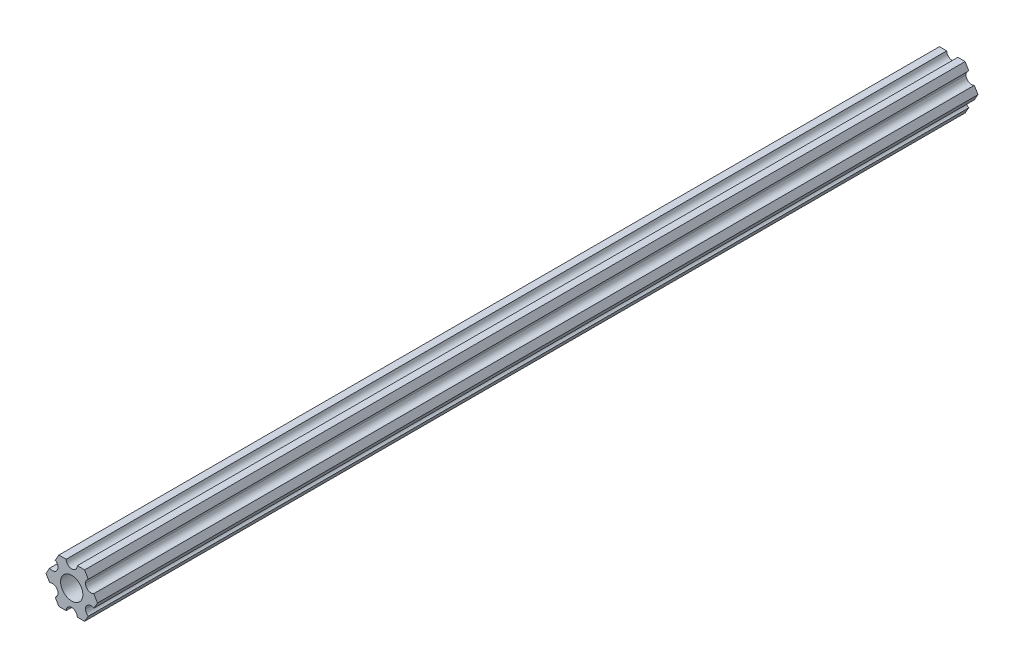
ISO-10303-21;
HEADER;
FILE_DESCRIPTION(('STEP AP214'),'2;1');
FILE_NAME('part.step','',(''),(''),'','','');
FILE_SCHEMA(('AUTOMOTIVE_DESIGN { 1 0 10303 214 1 1 1 1 }'));
ENDSEC;
DATA;
#1=APPLICATION_CONTEXT('core data for automotive mechanical design processes');
#2=APPLICATION_PROTOCOL_DEFINITION('international standard','automotive_design',2000,#1);
#3=PRODUCT_CONTEXT('',#1,'mechanical');
#4=PRODUCT('Part','Part','',(#3));
#5=PRODUCT_RELATED_PRODUCT_CATEGORY('part','',(#4));
#6=PRODUCT_DEFINITION_FORMATION('','',#4);
#7=PRODUCT_DEFINITION_CONTEXT('part definition',#1,'design');
#8=PRODUCT_DEFINITION('design','',#6,#7);
#9=PRODUCT_DEFINITION_SHAPE('','',#8);
#10=(LENGTH_UNIT() NAMED_UNIT(*) SI_UNIT(.MILLI.,.METRE.));
#11=(NAMED_UNIT(*) PLANE_ANGLE_UNIT() SI_UNIT($,.RADIAN.));
#12=(NAMED_UNIT(*) SI_UNIT($,.STERADIAN.) SOLID_ANGLE_UNIT());
#13=UNCERTAINTY_MEASURE_WITH_UNIT(LENGTH_MEASURE(1.E-05),#10,'distance_accuracy_value','');
#14=(GEOMETRIC_REPRESENTATION_CONTEXT(3) GLOBAL_UNCERTAINTY_ASSIGNED_CONTEXT((#13)) GLOBAL_UNIT_ASSIGNED_CONTEXT((#10,
#11,#12)) REPRESENTATION_CONTEXT('',''));
#15=CARTESIAN_POINT('',(0.,0.,0.));
#16=DIRECTION('',(0.,0.,1.));
#17=DIRECTION('',(1.,0.,0.));
#18=AXIS2_PLACEMENT_3D('',#15,#16,#17);
#19=CARTESIAN_POINT('',(-7.33234841870827,6.3499997778937,250.952));
#20=DIRECTION('',(0.,0.,-1.));
#21=DIRECTION('',(-1.,0.,0.));
#22=AXIS2_PLACEMENT_3D('',#19,#20,#21);
#23=PLANE('',#22);
#24=DIRECTION('',(1.,0.,0.));
#25=VECTOR('',#24,1.);
#26=CARTESIAN_POINT('',(-7.33234841870827,6.3499997778937,250.952));
#27=LINE('',#26,#25);
#28=CARTESIAN_POINT('',(-3.66617459405349,6.3499997778937,250.952));
#29=VERTEX_POINT('',#28);
#30=CARTESIAN_POINT('',(-1.58750038469926,6.3499997778937,250.952));
#31=VERTEX_POINT('',#30);
#32=EDGE_CURVE('E416',#29,#31,#27,.T.);
#33=ORIENTED_EDGE('',*,*,#32,.F.);
#34=DIRECTION('',(0.499999947533942,0.866025434075729,0.));
#35=VECTOR('',#34,1.);
#36=CARTESIAN_POINT('',(-3.66617459405349,6.3499997778937,250.952));
#37=LINE('',#36,#35);
#38=CARTESIAN_POINT('',(-4.70551158967065,4.54981504343587,250.952));
#39=VERTEX_POINT('',#38);
#40=EDGE_CURVE('E375',#39,#29,#37,.T.);
#41=ORIENTED_EDGE('',*,*,#40,.F.);
#42=CARTESIAN_POINT('',(-5.49926150638082,3.17499966684067,250.952));
#43=DIRECTION('',(0.,0.,-1.));
#44=DIRECTION('',(-1.,0.,0.));
#45=AXIS2_PLACEMENT_3D('',#42,#43,#44);
#46=CIRCLE('',#45,1.5875);
#47=CARTESIAN_POINT('',(-6.29301142309098,1.80018429024547,250.952));
#48=VERTEX_POINT('',#47);
#49=EDGE_CURVE('E378',#48,#39,#46,.F.);
#50=ORIENTED_EDGE('',*,*,#49,.F.);
#51=DIRECTION('',(0.499999947533952,0.866025434075724,0.));
#52=VECTOR('',#51,1.);
#53=CARTESIAN_POINT('',(-6.29301142309098,1.80018429024547,250.952));
#54=LINE('',#53,#52);
#55=CARTESIAN_POINT('',(-7.33234841870827,-4.44212523535714E-07,250.952));
#56=VERTEX_POINT('',#55);
#57=EDGE_CURVE('E381',#56,#48,#54,.T.);
#58=ORIENTED_EDGE('',*,*,#57,.F.);
#59=DIRECTION('',(-0.500000052466045,0.866025373493151,0.));
#60=VECTOR('',#59,1.);
#61=CARTESIAN_POINT('',(-7.33234841870827,-4.44212523790841E-07,250.952));
#62=LINE('',#61,#60);
#63=CARTESIAN_POINT('',(-6.29301120497141,-1.80018505273896,250.952));
#64=VERTEX_POINT('',#63);
#65=EDGE_CURVE('E384',#64,#56,#62,.T.);
#66=ORIENTED_EDGE('',*,*,#65,.F.);
#67=CARTESIAN_POINT('',(-5.49926112168156,-3.17500033315934,250.952));
#68=DIRECTION('',(0.,0.,-1.));
#69=DIRECTION('',(-1.,0.,0.));
#70=AXIS2_PLACEMENT_3D('',#67,#68,#69);
#71=CIRCLE('',#70,1.5875);
#72=CARTESIAN_POINT('',(-4.70551103839172,-4.54981561357972,250.952));
#73=VERTEX_POINT('',#72);
#74=EDGE_CURVE('E387',#73,#64,#71,.F.);
#75=ORIENTED_EDGE('',*,*,#74,.F.);
#76=DIRECTION('',(-0.500000052466045,0.866025373493152,0.));
#77=VECTOR('',#76,1.);
#78=CARTESIAN_POINT('',(-4.70551103839172,-4.54981561357972,250.952));
#79=LINE('',#78,#77);
#80=CARTESIAN_POINT('',(-3.66617382465481,-6.35000022210628,250.952));
#81=VERTEX_POINT('',#80);
#82=EDGE_CURVE('E390',#81,#73,#79,.T.);
#83=ORIENTED_EDGE('',*,*,#82,.F.);
#84=DIRECTION('',(1.,0.,0.));
#85=VECTOR('',#84,1.);
#86=CARTESIAN_POINT('',(-7.33234841870827,-6.35000022210628,250.952));
#87=LINE('',#86,#85);
#88=CARTESIAN_POINT('',(-1.58749961530072,-6.35000022210628,250.952));
#89=VERTEX_POINT('',#88);
#90=EDGE_CURVE('E419',#81,#89,#87,.T.);
#91=ORIENTED_EDGE('',*,*,#90,.T.);
#92=CARTESIAN_POINT('',(3.8469926204343E-07,-6.35,250.952));
#93=DIRECTION('',(0.,0.,-1.));
#94=DIRECTION('',(-1.,0.,0.));
#95=AXIS2_PLACEMENT_3D('',#92,#93,#94);
#96=CIRCLE('',#95,1.5875);
#97=CARTESIAN_POINT('',(1.58750038469926,-6.35000022210628,250.952));
#98=VERTEX_POINT('',#97);
#99=EDGE_CURVE('E393',#98,#89,#96,.F.);
#100=ORIENTED_EDGE('',*,*,#99,.F.);
#101=CARTESIAN_POINT('',(3.66617433758727,-6.35000022210628,250.952));
#102=VERTEX_POINT('',#101);
#103=EDGE_CURVE('E417',#98,#102,#87,.T.);
#104=ORIENTED_EDGE('',*,*,#103,.T.);
#105=DIRECTION('',(-0.499999947533941,-0.86602543407573,0.));
#106=VECTOR('',#105,1.);
#107=CARTESIAN_POINT('',(3.66617459405346,-6.34999977789375,250.952));
#108=LINE('',#107,#106);
#109=CARTESIAN_POINT('',(4.70551158967065,-4.54981504343587,250.952));
#110=VERTEX_POINT('',#109);
#111=EDGE_CURVE('E412',#110,#102,#108,.T.);
#112=ORIENTED_EDGE('',*,*,#111,.F.);
#113=CARTESIAN_POINT('',(5.49926150638082,-3.17499966684067,250.952));
#114=DIRECTION('',(0.,0.,-1.));
#115=DIRECTION('',(-1.,0.,0.));
#116=AXIS2_PLACEMENT_3D('',#113,#114,#115);
#117=CIRCLE('',#116,1.5875);
#118=CARTESIAN_POINT('',(3.91176150638082,-3.17499966684067,250.952));
#119=VERTEX_POINT('',#118);
#120=EDGE_CURVE('E414',#119,#110,#117,.F.);
#121=ORIENTED_EDGE('',*,*,#120,.F.);
#122=CARTESIAN_POINT('',(5.49926150638082,-3.17499966684067,250.952));
#123=DIRECTION('',(0.,0.,-1.));
#124=DIRECTION('',(-1.,0.,0.));
#125=AXIS2_PLACEMENT_3D('',#122,#123,#124);
#126=CIRCLE('',#125,1.5875);
#127=CARTESIAN_POINT('',(6.29301142309098,-1.80018429024546,250.952));
#128=VERTEX_POINT('',#127);
#129=EDGE_CURVE('E409',#128,#119,#126,.F.);
#130=ORIENTED_EDGE('',*,*,#129,.F.);
#131=DIRECTION('',(-0.499999947533953,-0.866025434075723,0.));
#132=VECTOR('',#131,1.);
#133=CARTESIAN_POINT('',(6.29301142309098,-1.80018429024546,250.952));
#134=LINE('',#133,#132);
#135=CARTESIAN_POINT('',(7.33234841870827,4.44212519198905E-07,250.952));
#136=VERTEX_POINT('',#135);
#137=EDGE_CURVE('E406',#136,#128,#134,.T.);
#138=ORIENTED_EDGE('',*,*,#137,.F.);
#139=DIRECTION('',(0.500000052466057,-0.866025373493145,0.));
#140=VECTOR('',#139,1.);
#141=CARTESIAN_POINT('',(7.33234841870827,4.44212519169686E-07,250.952));
#142=LINE('',#141,#140);
#143=CARTESIAN_POINT('',(6.2930112049714,1.80018505273894,250.952));
#144=VERTEX_POINT('',#143);
#145=EDGE_CURVE('E404',#144,#136,#142,.T.);
#146=ORIENTED_EDGE('',*,*,#145,.F.);
#147=CARTESIAN_POINT('',(5.49926112168156,3.17500033315934,250.952));
#148=DIRECTION('',(0.,0.,-1.));
#149=DIRECTION('',(-1.,0.,0.));
#150=AXIS2_PLACEMENT_3D('',#147,#148,#149);
#151=CIRCLE('',#150,1.5875);
#152=CARTESIAN_POINT('',(3.91176112168156,3.17500033315934,250.952));
#153=VERTEX_POINT('',#152);
#154=EDGE_CURVE('E402',#153,#144,#151,.F.);
#155=ORIENTED_EDGE('',*,*,#154,.F.);
#156=CARTESIAN_POINT('',(5.49926112168156,3.17500033315934,250.952));
#157=DIRECTION('',(0.,0.,-1.));
#158=DIRECTION('',(-1.,0.,0.));
#159=AXIS2_PLACEMENT_3D('',#156,#157,#158);
#160=CIRCLE('',#159,1.5875);
#161=CARTESIAN_POINT('',(4.70551103839172,4.54981561357972,250.952));
#162=VERTEX_POINT('',#161);
#163=EDGE_CURVE('E399',#162,#153,#160,.F.);
#164=ORIENTED_EDGE('',*,*,#163,.F.);
#165=DIRECTION('',(0.500000052466046,-0.866025373493151,0.));
#166=VECTOR('',#165,1.);
#167=CARTESIAN_POINT('',(4.70551103839172,4.54981561357972,250.952));
#168=LINE('',#167,#166);
#169=CARTESIAN_POINT('',(3.66617382465481,6.3499997778937,250.952));
#170=VERTEX_POINT('',#169);
#171=EDGE_CURVE('E396',#170,#162,#168,.T.);
#172=ORIENTED_EDGE('',*,*,#171,.F.);
#173=CARTESIAN_POINT('',(1.58749961530072,6.3499997778937,250.952));
#174=VERTEX_POINT('',#173);
#175=EDGE_CURVE('E421',#174,#170,#27,.T.);
#176=ORIENTED_EDGE('',*,*,#175,.F.);
#177=CARTESIAN_POINT('',(-3.84699260060323E-07,6.35,250.952));
#178=DIRECTION('',(0.,0.,-1.));
#179=DIRECTION('',(-1.,0.,0.));
#180=AXIS2_PLACEMENT_3D('',#177,#178,#179);
#181=CIRCLE('',#180,1.5875);
#182=EDGE_CURVE('E372',#31,#174,#181,.F.);
#183=ORIENTED_EDGE('',*,*,#182,.F.);
#184=EDGE_LOOP('',(#33,#41,#50,#58,#66,#75,#83,#91,#100,#104,#112,#121,#130,#138,#146,#155,#164,
#172,#176,#183));
#185=FACE_BOUND('',#184,.T.);
#186=CARTESIAN_POINT('',(0.,0.,250.952));
#187=DIRECTION('',(0.,0.,1.));
#188=DIRECTION('',(1.,0.,0.));
#189=AXIS2_PLACEMENT_3D('',#186,#187,#188);
#190=CIRCLE('',#189,3.17499999999999);
#191=CARTESIAN_POINT('',(3.17499999999999,0.,250.952));
#192=VERTEX_POINT('',#191);
#193=EDGE_CURVE('E434',#192,#192,#190,.T.);
#194=ORIENTED_EDGE('',*,*,#193,.F.);
#195=EDGE_LOOP('',(#194));
#196=FACE_BOUND('',#195,.T.);
#197=ADVANCED_FACE('F56',(#185,#196),#23,.F.);
#198=CARTESIAN_POINT('',(5.49926112168156,3.17500033315934,0.));
#199=DIRECTION('',(0.,0.,1.));
#200=DIRECTION('',(1.,0.,0.));
#201=AXIS2_PLACEMENT_3D('',#198,#199,#200);
#202=PLANE('',#201);
#203=DIRECTION('',(0.499999947533953,0.866025434075723,0.));
#204=VECTOR('',#203,1.);
#205=CARTESIAN_POINT('',(6.29301142309098,-1.80018429024546,0.));
#206=LINE('',#205,#204);
#207=CARTESIAN_POINT('',(6.29301142309098,-1.80018429024546,0.));
#208=VERTEX_POINT('',#207);
#209=CARTESIAN_POINT('',(7.33234841870827,4.44212519169686E-07,0.));
#210=VERTEX_POINT('',#209);
#211=EDGE_CURVE('E253',#208,#210,#206,.T.);
#212=ORIENTED_EDGE('',*,*,#211,.F.);
#213=CARTESIAN_POINT('',(5.49926150638082,-3.17499966684067,0.));
#214=DIRECTION('',(0.,0.,-1.));
#215=DIRECTION('',(1.,0.,0.));
#216=AXIS2_PLACEMENT_3D('',#213,#214,#215);
#217=CIRCLE('',#216,1.5875);
#218=CARTESIAN_POINT('',(3.91176150638082,-3.17499966684067,0.));
#219=VERTEX_POINT('',#218);
#220=EDGE_CURVE('E233',#219,#208,#217,.T.);
#221=ORIENTED_EDGE('',*,*,#220,.F.);
#222=CARTESIAN_POINT('',(5.49926150638082,-3.17499966684067,0.));
#223=DIRECTION('',(0.,0.,-1.));
#224=DIRECTION('',(1.,0.,0.));
#225=AXIS2_PLACEMENT_3D('',#222,#223,#224);
#226=CIRCLE('',#225,1.5875);
#227=CARTESIAN_POINT('',(4.70551158967065,-4.54981504343587,0.));
#228=VERTEX_POINT('',#227);
#229=EDGE_CURVE('E325',#228,#219,#226,.T.);
#230=ORIENTED_EDGE('',*,*,#229,.F.);
#231=DIRECTION('',(0.499999947533941,0.86602543407573,0.));
#232=VECTOR('',#231,1.);
#233=CARTESIAN_POINT('',(3.66617459405346,-6.34999977789375,0.));
#234=LINE('',#233,#232);
#235=CARTESIAN_POINT('',(3.66617459405346,-6.34999977789375,0.));
#236=VERTEX_POINT('',#235);
#237=EDGE_CURVE('E296',#236,#228,#234,.T.);
#238=ORIENTED_EDGE('',*,*,#237,.F.);
#239=DIRECTION('',(1.,6.05825721258438E-08,0.));
#240=VECTOR('',#239,1.);
#241=CARTESIAN_POINT('',(1.58750038469926,-6.34999990382518,0.));
#242=LINE('',#241,#240);
#243=CARTESIAN_POINT('',(1.58750038469926,-6.34999990382518,0.));
#244=VERTEX_POINT('',#243);
#245=EDGE_CURVE('E239',#244,#236,#242,.T.);
#246=ORIENTED_EDGE('',*,*,#245,.F.);
#247=CARTESIAN_POINT('',(3.8469926204343E-07,-6.35,0.));
#248=DIRECTION('',(0.,0.,-1.));
#249=DIRECTION('',(1.,0.,0.));
#250=AXIS2_PLACEMENT_3D('',#247,#248,#249);
#251=CIRCLE('',#250,1.5875);
#252=CARTESIAN_POINT('',(-1.58749961530073,-6.35000009617482,0.));
#253=VERTEX_POINT('',#252);
#254=EDGE_CURVE('E287',#253,#244,#251,.T.);
#255=ORIENTED_EDGE('',*,*,#254,.F.);
#256=DIRECTION('',(1.,6.05825854783851E-08,0.));
#257=VECTOR('',#256,1.);
#258=CARTESIAN_POINT('',(-3.66617382465481,-6.35000022210628,0.));
#259=LINE('',#258,#257);
#260=CARTESIAN_POINT('',(-3.66617382465481,-6.35000022210628,0.));
#261=VERTEX_POINT('',#260);
#262=EDGE_CURVE('E356',#261,#253,#259,.T.);
#263=ORIENTED_EDGE('',*,*,#262,.F.);
#264=DIRECTION('',(0.500000052466045,-0.866025373493152,0.));
#265=VECTOR('',#264,1.);
#266=CARTESIAN_POINT('',(-4.70551103839172,-4.54981561357972,0.));
#267=LINE('',#266,#265);
#268=CARTESIAN_POINT('',(-4.70551103839172,-4.54981561357972,0.));
#269=VERTEX_POINT('',#268);
#270=EDGE_CURVE('E260',#269,#261,#267,.T.);
#271=ORIENTED_EDGE('',*,*,#270,.F.);
#272=CARTESIAN_POINT('',(-5.49926112168156,-3.17500033315934,0.));
#273=DIRECTION('',(0.,0.,-1.));
#274=DIRECTION('',(1.,0.,0.));
#275=AXIS2_PLACEMENT_3D('',#272,#273,#274);
#276=CIRCLE('',#275,1.5875);
#277=CARTESIAN_POINT('',(-6.29301120497141,-1.80018505273897,0.));
#278=VERTEX_POINT('',#277);
#279=EDGE_CURVE('E285',#278,#269,#276,.T.);
#280=ORIENTED_EDGE('',*,*,#279,.F.);
#281=DIRECTION('',(0.500000052466045,-0.866025373493151,0.));
#282=VECTOR('',#281,1.);
#283=CARTESIAN_POINT('',(-7.33234841870827,-4.44212523790841E-07,0.));
#284=LINE('',#283,#282);
#285=CARTESIAN_POINT('',(-7.33234841870827,-4.44212523790841E-07,0.));
#286=VERTEX_POINT('',#285);
#287=EDGE_CURVE('E284',#286,#278,#284,.T.);
#288=ORIENTED_EDGE('',*,*,#287,.F.);
#289=DIRECTION('',(-0.499999947533951,-0.866025434075724,0.));
#290=VECTOR('',#289,1.);
#291=CARTESIAN_POINT('',(-6.29301142309098,1.80018429024547,0.));
#292=LINE('',#291,#290);
#293=CARTESIAN_POINT('',(-6.29301142309098,1.80018429024547,0.));
#294=VERTEX_POINT('',#293);
#295=EDGE_CURVE('E269',#294,#286,#292,.T.);
#296=ORIENTED_EDGE('',*,*,#295,.F.);
#297=CARTESIAN_POINT('',(-5.49926150638082,3.17499966684067,0.));
#298=DIRECTION('',(0.,0.,-1.));
#299=DIRECTION('',(1.,0.,0.));
#300=AXIS2_PLACEMENT_3D('',#297,#298,#299);
#301=CIRCLE('',#300,1.5875);
#302=CARTESIAN_POINT('',(-4.70551158967065,4.54981504343587,0.));
#303=VERTEX_POINT('',#302);
#304=EDGE_CURVE('E237',#303,#294,#301,.T.);
#305=ORIENTED_EDGE('',*,*,#304,.F.);
#306=DIRECTION('',(-0.499999947533943,-0.866025434075729,0.));
#307=VECTOR('',#306,1.);
#308=CARTESIAN_POINT('',(-3.66617459405349,6.3499997778937,0.));
#309=LINE('',#308,#307);
#310=CARTESIAN_POINT('',(-3.66617459405349,6.3499997778937,0.));
#311=VERTEX_POINT('',#310);
#312=EDGE_CURVE('E245',#311,#303,#309,.T.);
#313=ORIENTED_EDGE('',*,*,#312,.F.);
#314=DIRECTION('',(-1.,-6.05825963273174E-08,0.));
#315=VECTOR('',#314,1.);
#316=CARTESIAN_POINT('',(-1.58750038469926,6.34999990382518,0.));
#317=LINE('',#316,#315);
#318=CARTESIAN_POINT('',(-1.58750038469926,6.34999990382519,0.));
#319=VERTEX_POINT('',#318);
#320=EDGE_CURVE('E311',#319,#311,#317,.T.);
#321=ORIENTED_EDGE('',*,*,#320,.F.);
#322=CARTESIAN_POINT('',(-3.84699260060323E-07,6.35,0.));
#323=DIRECTION('',(0.,0.,-1.));
#324=DIRECTION('',(1.,0.,0.));
#325=AXIS2_PLACEMENT_3D('',#322,#323,#324);
#326=CIRCLE('',#325,1.5875);
#327=CARTESIAN_POINT('',(1.58749961530074,6.35000009617482,0.));
#328=VERTEX_POINT('',#327);
#329=EDGE_CURVE('E301',#328,#319,#326,.T.);
#330=ORIENTED_EDGE('',*,*,#329,.F.);
#331=DIRECTION('',(-1.,-6.05825850611185E-08,0.));
#332=VECTOR('',#331,1.);
#333=CARTESIAN_POINT('',(3.66617382465481,6.35000022210627,0.));
#334=LINE('',#333,#332);
#335=CARTESIAN_POINT('',(3.66617382465481,6.35000022210627,0.));
#336=VERTEX_POINT('',#335);
#337=EDGE_CURVE('E277',#336,#328,#334,.T.);
#338=ORIENTED_EDGE('',*,*,#337,.F.);
#339=DIRECTION('',(-0.500000052466046,0.866025373493151,0.));
#340=VECTOR('',#339,1.);
#341=CARTESIAN_POINT('',(4.70551103839172,4.54981561357972,0.));
#342=LINE('',#341,#340);
#343=CARTESIAN_POINT('',(4.70551103839172,4.54981561357972,0.));
#344=VERTEX_POINT('',#343);
#345=EDGE_CURVE('E270',#344,#336,#342,.T.);
#346=ORIENTED_EDGE('',*,*,#345,.F.);
#347=CARTESIAN_POINT('',(5.49926112168156,3.17500033315934,0.));
#348=DIRECTION('',(0.,0.,-1.));
#349=DIRECTION('',(1.,0.,0.));
#350=AXIS2_PLACEMENT_3D('',#347,#348,#349);
#351=CIRCLE('',#350,1.5875);
#352=CARTESIAN_POINT('',(3.91176112168156,3.17500033315934,0.));
#353=VERTEX_POINT('',#352);
#354=EDGE_CURVE('E255',#353,#344,#351,.T.);
#355=ORIENTED_EDGE('',*,*,#354,.F.);
#356=CARTESIAN_POINT('',(5.49926112168156,3.17500033315934,0.));
#357=DIRECTION('',(0.,0.,-1.));
#358=DIRECTION('',(1.,0.,0.));
#359=AXIS2_PLACEMENT_3D('',#356,#357,#358);
#360=CIRCLE('',#359,1.5875);
#361=CARTESIAN_POINT('',(6.29301120497139,1.80018505273894,0.));
#362=VERTEX_POINT('',#361);
#363=EDGE_CURVE('E274',#362,#353,#360,.T.);
#364=ORIENTED_EDGE('',*,*,#363,.F.);
#365=DIRECTION('',(-0.500000052466056,0.866025373493145,0.));
#366=VECTOR('',#365,1.);
#367=CARTESIAN_POINT('',(7.33234841870827,4.44212519169686E-07,0.));
#368=LINE('',#367,#366);
#369=EDGE_CURVE('E254',#210,#362,#368,.T.);
#370=ORIENTED_EDGE('',*,*,#369,.F.);
#371=EDGE_LOOP('',(#212,#221,#230,#238,#246,#255,#263,#271,#280,#288,#296,#305,#313,#321,#330,
#338,#346,#355,#364,#370));
#372=FACE_BOUND('',#371,.T.);
#373=CARTESIAN_POINT('',(0.,0.,0.));
#374=DIRECTION('',(0.,0.,-1.));
#375=DIRECTION('',(-1.,0.,0.));
#376=AXIS2_PLACEMENT_3D('',#373,#374,#375);
#377=CIRCLE('',#376,3.175);
#378=CARTESIAN_POINT('',(-3.175,0.,0.));
#379=VERTEX_POINT('',#378);
#380=EDGE_CURVE('E428',#379,#379,#377,.T.);
#381=ORIENTED_EDGE('',*,*,#380,.F.);
#382=EDGE_LOOP('',(#381));
#383=FACE_BOUND('',#382,.T.);
#384=ADVANCED_FACE('F441',(#372,#383),#202,.F.);
#385=CARTESIAN_POINT('',(0.,0.,304.8));
#386=DIRECTION('',(0.,0.,-1.));
#387=DIRECTION('',(-1.,0.,0.));
#388=AXIS2_PLACEMENT_3D('',#385,#386,#387);
#389=CYLINDRICAL_SURFACE('',#388,2.9337);
#390=DIRECTION('',(0.,0.,-1.));
#391=VECTOR('',#390,1.);
#392=CARTESIAN_POINT('',(-2.9337,0.,304.8));
#393=LINE('',#392,#391);
#394=CARTESIAN_POINT('',(-2.9337,0.,228.727));
#395=VERTEX_POINT('',#394);
#396=CARTESIAN_POINT('',(-2.9337,0.,22.225));
#397=VERTEX_POINT('',#396);
#398=EDGE_CURVE('E225',#395,#397,#393,.T.);
#399=ORIENTED_EDGE('',*,*,#398,.F.);
#400=CARTESIAN_POINT('',(0.,0.,228.727));
#401=DIRECTION('',(0.,0.,-1.));
#402=DIRECTION('',(-1.,0.,0.));
#403=AXIS2_PLACEMENT_3D('',#400,#401,#402);
#404=CIRCLE('',#403,2.9337);
#405=CARTESIAN_POINT('',(2.9337,0.,228.727));
#406=VERTEX_POINT('',#405);
#407=EDGE_CURVE('E64',#395,#406,#404,.F.);
#408=ORIENTED_EDGE('',*,*,#407,.T.);
#409=DIRECTION('',(0.,0.,-1.));
#410=VECTOR('',#409,1.);
#411=CARTESIAN_POINT('',(2.9337,0.,304.8));
#412=LINE('',#411,#410);
#413=CARTESIAN_POINT('',(2.9337,0.,22.225));
#414=VERTEX_POINT('',#413);
#415=EDGE_CURVE('E75',#406,#414,#412,.T.);
#416=ORIENTED_EDGE('',*,*,#415,.T.);
#417=CARTESIAN_POINT('',(0.,0.,22.225));
#418=DIRECTION('',(0.,0.,1.));
#419=DIRECTION('',(1.,0.,0.));
#420=AXIS2_PLACEMENT_3D('',#417,#418,#419);
#421=CIRCLE('',#420,2.9337);
#422=EDGE_CURVE('E420',#414,#397,#421,.F.);
#423=ORIENTED_EDGE('',*,*,#422,.T.);
#424=EDGE_LOOP('',(#399,#408,#416,#423));
#425=FACE_BOUND('',#424,.T.);
#426=ADVANCED_FACE('F224',(#425),#389,.F.);
#427=CARTESIAN_POINT('',(5.49926150638082,-3.17499966684067,304.8));
#428=DIRECTION('',(0.,0.,-1.));
#429=DIRECTION('',(-1.,0.,0.));
#430=AXIS2_PLACEMENT_3D('',#427,#428,#429);
#431=CYLINDRICAL_SURFACE('',#430,1.5875);
#432=DIRECTION('',(0.,0.,-1.));
#433=VECTOR('',#432,1.);
#434=CARTESIAN_POINT('',(6.29301142309098,-1.80018429024546,304.8));
#435=LINE('',#434,#433);
#436=EDGE_CURVE('E251',#128,#208,#435,.T.);
#437=ORIENTED_EDGE('',*,*,#436,.F.);
#438=ORIENTED_EDGE('',*,*,#129,.T.);
#439=DIRECTION('',(0.,0.,-1.));
#440=VECTOR('',#439,1.);
#441=CARTESIAN_POINT('',(3.91176150638082,-3.17499966684067,304.8));
#442=LINE('',#441,#440);
#443=EDGE_CURVE('E230',#119,#219,#442,.T.);
#444=ORIENTED_EDGE('',*,*,#443,.T.);
#445=ORIENTED_EDGE('',*,*,#220,.T.);
#446=EDGE_LOOP('',(#437,#438,#444,#445));
#447=FACE_BOUND('',#446,.T.);
#448=ADVANCED_FACE('F494',(#447),#431,.F.);
#449=CARTESIAN_POINT('',(5.49926112168156,3.17500033315934,304.8));
#450=DIRECTION('',(0.,0.,-1.));
#451=DIRECTION('',(-1.,0.,0.));
#452=AXIS2_PLACEMENT_3D('',#449,#450,#451);
#453=CYLINDRICAL_SURFACE('',#452,1.5875);
#454=DIRECTION('',(0.,0.,-1.));
#455=VECTOR('',#454,1.);
#456=CARTESIAN_POINT('',(4.70551103839172,4.54981561357972,304.8));
#457=LINE('',#456,#455);
#458=EDGE_CURVE('E275',#162,#344,#457,.T.);
#459=ORIENTED_EDGE('',*,*,#458,.F.);
#460=ORIENTED_EDGE('',*,*,#163,.T.);
#461=DIRECTION('',(0.,0.,-1.));
#462=VECTOR('',#461,1.);
#463=CARTESIAN_POINT('',(3.91176112168156,3.17500033315934,304.8));
#464=LINE('',#463,#462);
#465=EDGE_CURVE('E259',#153,#353,#464,.T.);
#466=ORIENTED_EDGE('',*,*,#465,.T.);
#467=ORIENTED_EDGE('',*,*,#354,.T.);
#468=EDGE_LOOP('',(#459,#460,#466,#467));
#469=FACE_BOUND('',#468,.T.);
#470=ADVANCED_FACE('F497',(#469),#453,.F.);
#471=CARTESIAN_POINT('',(6.29301142309098,-1.80018429024546,304.8));
#472=DIRECTION('',(-0.866025434075723,0.499999947533953,0.));
#473=DIRECTION('',(0.,0.,1.));
#474=AXIS2_PLACEMENT_3D('',#471,#472,#473);
#475=PLANE('',#474);
#476=DIRECTION('',(0.,0.,-1.));
#477=VECTOR('',#476,1.);
#478=CARTESIAN_POINT('',(7.33234841870827,4.44212519169686E-07,304.8));
#479=LINE('',#478,#477);
#480=EDGE_CURVE('E335',#136,#210,#479,.T.);
#481=ORIENTED_EDGE('',*,*,#480,.F.);
#482=ORIENTED_EDGE('',*,*,#137,.T.);
#483=ORIENTED_EDGE('',*,*,#436,.T.);
#484=ORIENTED_EDGE('',*,*,#211,.T.);
#485=EDGE_LOOP('',(#481,#482,#483,#484));
#486=FACE_BOUND('',#485,.T.);
#487=ADVANCED_FACE('F462',(#486),#475,.F.);
#488=CARTESIAN_POINT('',(7.33234841870827,4.44212519169686E-07,304.8));
#489=DIRECTION('',(-0.866025373493145,-0.500000052466057,0.));
#490=DIRECTION('',(-0.500000052466057,0.866025373493145,0.));
#491=AXIS2_PLACEMENT_3D('',#488,#489,#490);
#492=PLANE('',#491);
#493=DIRECTION('',(0.,0.,-1.));
#494=VECTOR('',#493,1.);
#495=CARTESIAN_POINT('',(6.29301120497139,1.80018505273894,304.8));
#496=LINE('',#495,#494);
#497=EDGE_CURVE('E281',#144,#362,#496,.T.);
#498=ORIENTED_EDGE('',*,*,#497,.F.);
#499=ORIENTED_EDGE('',*,*,#145,.T.);
#500=ORIENTED_EDGE('',*,*,#480,.T.);
#501=ORIENTED_EDGE('',*,*,#369,.T.);
#502=EDGE_LOOP('',(#498,#499,#500,#501));
#503=FACE_BOUND('',#502,.T.);
#504=ADVANCED_FACE('F458',(#503),#492,.F.);
#505=CARTESIAN_POINT('',(5.49926112168156,3.17500033315934,304.8));
#506=DIRECTION('',(0.,0.,-1.));
#507=DIRECTION('',(-1.,0.,0.));
#508=AXIS2_PLACEMENT_3D('',#505,#506,#507);
#509=CYLINDRICAL_SURFACE('',#508,1.5875);
#510=ORIENTED_EDGE('',*,*,#465,.F.);
#511=ORIENTED_EDGE('',*,*,#154,.T.);
#512=ORIENTED_EDGE('',*,*,#497,.T.);
#513=ORIENTED_EDGE('',*,*,#363,.T.);
#514=EDGE_LOOP('',(#510,#511,#512,#513));
#515=FACE_BOUND('',#514,.T.);
#516=ADVANCED_FACE('F461',(#515),#509,.F.);
#517=CARTESIAN_POINT('',(4.70551103839172,4.54981561357972,304.8));
#518=DIRECTION('',(-0.866025373493151,-0.500000052466046,0.));
#519=DIRECTION('',(-0.500000052466046,0.866025373493151,0.));
#520=AXIS2_PLACEMENT_3D('',#517,#518,#519);
#521=PLANE('',#520);
#522=DIRECTION('',(0.,0.,-1.));
#523=VECTOR('',#522,1.);
#524=CARTESIAN_POINT('',(3.66617382465481,6.35000022210627,304.8));
#525=LINE('',#524,#523);
#526=EDGE_CURVE('E295',#170,#336,#525,.T.);
#527=ORIENTED_EDGE('',*,*,#526,.F.);
#528=ORIENTED_EDGE('',*,*,#171,.T.);
#529=ORIENTED_EDGE('',*,*,#458,.T.);
#530=ORIENTED_EDGE('',*,*,#345,.T.);
#531=EDGE_LOOP('',(#527,#528,#529,#530));
#532=FACE_BOUND('',#531,.T.);
#533=ADVANCED_FACE('F467',(#532),#521,.F.);
#534=CARTESIAN_POINT('',(3.66617382465481,6.35000022210627,304.8));
#535=DIRECTION('',(6.05825850611185E-08,-1.,0.));
#536=DIRECTION('',(0.,0.,-1.));
#537=AXIS2_PLACEMENT_3D('',#534,#535,#536);
#538=PLANE('',#537);
#539=DIRECTION('',(0.,0.,-1.));
#540=VECTOR('',#539,1.);
#541=CARTESIAN_POINT('',(1.58749961530074,6.35000009617482,304.8));
#542=LINE('',#541,#540);
#543=EDGE_CURVE('E304',#174,#328,#542,.T.);
#544=ORIENTED_EDGE('',*,*,#543,.F.);
#545=ORIENTED_EDGE('',*,*,#175,.T.);
#546=ORIENTED_EDGE('',*,*,#526,.T.);
#547=ORIENTED_EDGE('',*,*,#337,.T.);
#548=EDGE_LOOP('',(#544,#545,#546,#547));
#549=FACE_BOUND('',#548,.T.);
#550=ADVANCED_FACE('F463',(#549),#538,.F.);
#551=CARTESIAN_POINT('',(-3.84699260060323E-07,6.35,304.8));
#552=DIRECTION('',(0.,0.,-1.));
#553=DIRECTION('',(-1.,0.,0.));
#554=AXIS2_PLACEMENT_3D('',#551,#552,#553);
#555=CYLINDRICAL_SURFACE('',#554,1.5875);
#556=DIRECTION('',(0.,0.,-1.));
#557=VECTOR('',#556,1.);
#558=CARTESIAN_POINT('',(-1.58750038469926,6.34999990382519,304.8));
#559=LINE('',#558,#557);
#560=EDGE_CURVE('E249',#31,#319,#559,.T.);
#561=ORIENTED_EDGE('',*,*,#560,.F.);
#562=ORIENTED_EDGE('',*,*,#182,.T.);
#563=ORIENTED_EDGE('',*,*,#543,.T.);
#564=ORIENTED_EDGE('',*,*,#329,.T.);
#565=EDGE_LOOP('',(#561,#562,#563,#564));
#566=FACE_BOUND('',#565,.T.);
#567=ADVANCED_FACE('F466',(#566),#555,.F.);
#568=CARTESIAN_POINT('',(-1.58750038469926,6.34999990382518,304.8));
#569=DIRECTION('',(6.05825963273174E-08,-1.,0.));
#570=DIRECTION('',(0.,0.,-1.));
#571=AXIS2_PLACEMENT_3D('',#568,#569,#570);
#572=PLANE('',#571);
#573=DIRECTION('',(0.,0.,-1.));
#574=VECTOR('',#573,1.);
#575=CARTESIAN_POINT('',(-3.66617459405349,6.3499997778937,304.8));
#576=LINE('',#575,#574);
#577=EDGE_CURVE('E250',#29,#311,#576,.T.);
#578=ORIENTED_EDGE('',*,*,#577,.F.);
#579=ORIENTED_EDGE('',*,*,#32,.T.);
#580=ORIENTED_EDGE('',*,*,#560,.T.);
#581=ORIENTED_EDGE('',*,*,#320,.T.);
#582=EDGE_LOOP('',(#578,#579,#580,#581));
#583=FACE_BOUND('',#582,.T.);
#584=ADVANCED_FACE('F476',(#583),#572,.F.);
#585=CARTESIAN_POINT('',(-3.66617459405349,6.3499997778937,304.8));
#586=DIRECTION('',(0.866025434075729,-0.499999947533942,0.));
#587=DIRECTION('',(0.,0.,-1.));
#588=AXIS2_PLACEMENT_3D('',#585,#586,#587);
#589=PLANE('',#588);
#590=DIRECTION('',(0.,0.,-1.));
#591=VECTOR('',#590,1.);
#592=CARTESIAN_POINT('',(-4.70551158967065,4.54981504343587,304.8));
#593=LINE('',#592,#591);
#594=EDGE_CURVE('E267',#39,#303,#593,.T.);
#595=ORIENTED_EDGE('',*,*,#594,.F.);
#596=ORIENTED_EDGE('',*,*,#40,.T.);
#597=ORIENTED_EDGE('',*,*,#577,.T.);
#598=ORIENTED_EDGE('',*,*,#312,.T.);
#599=EDGE_LOOP('',(#595,#596,#597,#598));
#600=FACE_BOUND('',#599,.T.);
#601=ADVANCED_FACE('F472',(#600),#589,.F.);
#602=CARTESIAN_POINT('',(-5.49926150638082,3.17499966684067,304.8));
#603=DIRECTION('',(0.,0.,-1.));
#604=DIRECTION('',(-1.,0.,0.));
#605=AXIS2_PLACEMENT_3D('',#602,#603,#604);
#606=CYLINDRICAL_SURFACE('',#605,1.5875);
#607=DIRECTION('',(0.,0.,-1.));
#608=VECTOR('',#607,1.);
#609=CARTESIAN_POINT('',(-6.29301142309098,1.80018429024547,304.8));
#610=LINE('',#609,#608);
#611=EDGE_CURVE('E291',#48,#294,#610,.T.);
#612=ORIENTED_EDGE('',*,*,#611,.F.);
#613=ORIENTED_EDGE('',*,*,#49,.T.);
#614=ORIENTED_EDGE('',*,*,#594,.T.);
#615=ORIENTED_EDGE('',*,*,#304,.T.);
#616=EDGE_LOOP('',(#612,#613,#614,#615));
#617=FACE_BOUND('',#616,.T.);
#618=ADVANCED_FACE('F469',(#617),#606,.F.);
#619=CARTESIAN_POINT('',(-6.29301142309098,1.80018429024547,304.8));
#620=DIRECTION('',(0.866025434075724,-0.499999947533952,0.));
#621=DIRECTION('',(0.,0.,-1.));
#622=AXIS2_PLACEMENT_3D('',#619,#620,#621);
#623=PLANE('',#622);
#624=DIRECTION('',(0.,0.,-1.));
#625=VECTOR('',#624,1.);
#626=CARTESIAN_POINT('',(-7.33234841870827,-4.44212523790841E-07,304.8));
#627=LINE('',#626,#625);
#628=EDGE_CURVE('E282',#56,#286,#627,.T.);
#629=ORIENTED_EDGE('',*,*,#628,.F.);
#630=ORIENTED_EDGE('',*,*,#57,.T.);
#631=ORIENTED_EDGE('',*,*,#611,.T.);
#632=ORIENTED_EDGE('',*,*,#295,.T.);
#633=EDGE_LOOP('',(#629,#630,#631,#632));
#634=FACE_BOUND('',#633,.T.);
#635=ADVANCED_FACE('F58',(#634),#623,.F.);
#636=CARTESIAN_POINT('',(-7.33234841870827,-4.44212523790841E-07,304.8));
#637=DIRECTION('',(0.866025373493151,0.500000052466045,0.));
#638=DIRECTION('',(0.,0.,-1.));
#639=AXIS2_PLACEMENT_3D('',#636,#637,#638);
#640=PLANE('',#639);
#641=DIRECTION('',(0.,0.,-1.));
#642=VECTOR('',#641,1.);
#643=CARTESIAN_POINT('',(-6.29301120497141,-1.80018505273897,304.8));
#644=LINE('',#643,#642);
#645=EDGE_CURVE('E264',#64,#278,#644,.T.);
#646=ORIENTED_EDGE('',*,*,#645,.F.);
#647=ORIENTED_EDGE('',*,*,#65,.T.);
#648=ORIENTED_EDGE('',*,*,#628,.T.);
#649=ORIENTED_EDGE('',*,*,#287,.T.);
#650=EDGE_LOOP('',(#646,#647,#648,#649));
#651=FACE_BOUND('',#650,.T.);
#652=ADVANCED_FACE('F520',(#651),#640,.F.);
#653=CARTESIAN_POINT('',(-5.49926112168156,-3.17500033315934,304.8));
#654=DIRECTION('',(0.,0.,-1.));
#655=DIRECTION('',(-1.,0.,0.));
#656=AXIS2_PLACEMENT_3D('',#653,#654,#655);
#657=CYLINDRICAL_SURFACE('',#656,1.5875);
#658=DIRECTION('',(0.,0.,-1.));
#659=VECTOR('',#658,1.);
#660=CARTESIAN_POINT('',(-4.70551103839172,-4.54981561357972,304.8));
#661=LINE('',#660,#659);
#662=EDGE_CURVE('E265',#73,#269,#661,.T.);
#663=ORIENTED_EDGE('',*,*,#662,.F.);
#664=ORIENTED_EDGE('',*,*,#74,.T.);
#665=ORIENTED_EDGE('',*,*,#645,.T.);
#666=ORIENTED_EDGE('',*,*,#279,.T.);
#667=EDGE_LOOP('',(#663,#664,#665,#666));
#668=FACE_BOUND('',#667,.T.);
#669=ADVANCED_FACE('F479',(#668),#657,.F.);
#670=CARTESIAN_POINT('',(-4.70551103839172,-4.54981561357972,304.8));
#671=DIRECTION('',(0.866025373493152,0.500000052466045,0.));
#672=DIRECTION('',(0.,0.,-1.));
#673=AXIS2_PLACEMENT_3D('',#670,#671,#672);
#674=PLANE('',#673);
#675=DIRECTION('',(0.,0.,-1.));
#676=VECTOR('',#675,1.);
#677=CARTESIAN_POINT('',(-3.66617382465481,-6.35000022210628,304.8));
#678=LINE('',#677,#676);
#679=EDGE_CURVE('E354',#81,#261,#678,.T.);
#680=ORIENTED_EDGE('',*,*,#679,.F.);
#681=ORIENTED_EDGE('',*,*,#82,.T.);
#682=ORIENTED_EDGE('',*,*,#662,.T.);
#683=ORIENTED_EDGE('',*,*,#270,.T.);
#684=EDGE_LOOP('',(#680,#681,#682,#683));
#685=FACE_BOUND('',#684,.T.);
#686=ADVANCED_FACE('F456',(#685),#674,.F.);
#687=CARTESIAN_POINT('',(-3.66617382465481,-6.35000022210628,304.8));
#688=DIRECTION('',(-6.05825854783851E-08,1.,0.));
#689=DIRECTION('',(0.,0.,1.));
#690=AXIS2_PLACEMENT_3D('',#687,#688,#689);
#691=PLANE('',#690);
#692=DIRECTION('',(0.,0.,-1.));
#693=VECTOR('',#692,1.);
#694=CARTESIAN_POINT('',(-1.58749961530073,-6.35000009617482,304.8));
#695=LINE('',#694,#693);
#696=EDGE_CURVE('E243',#89,#253,#695,.T.);
#697=ORIENTED_EDGE('',*,*,#696,.F.);
#698=ORIENTED_EDGE('',*,*,#90,.F.);
#699=ORIENTED_EDGE('',*,*,#679,.T.);
#700=ORIENTED_EDGE('',*,*,#262,.T.);
#701=EDGE_LOOP('',(#697,#698,#699,#700));
#702=FACE_BOUND('',#701,.T.);
#703=ADVANCED_FACE('F452',(#702),#691,.F.);
#704=CARTESIAN_POINT('',(3.8469926204343E-07,-6.35,304.8));
#705=DIRECTION('',(0.,0.,-1.));
#706=DIRECTION('',(-1.,0.,0.));
#707=AXIS2_PLACEMENT_3D('',#704,#705,#706);
#708=CYLINDRICAL_SURFACE('',#707,1.5875);
#709=DIRECTION('',(0.,0.,-1.));
#710=VECTOR('',#709,1.);
#711=CARTESIAN_POINT('',(1.58750038469926,-6.34999990382518,304.8));
#712=LINE('',#711,#710);
#713=EDGE_CURVE('E244',#98,#244,#712,.T.);
#714=ORIENTED_EDGE('',*,*,#713,.F.);
#715=ORIENTED_EDGE('',*,*,#99,.T.);
#716=ORIENTED_EDGE('',*,*,#696,.T.);
#717=ORIENTED_EDGE('',*,*,#254,.T.);
#718=EDGE_LOOP('',(#714,#715,#716,#717));
#719=FACE_BOUND('',#718,.T.);
#720=ADVANCED_FACE('F455',(#719),#708,.F.);
#721=CARTESIAN_POINT('',(1.58750038469926,-6.34999990382518,304.8));
#722=DIRECTION('',(-6.05825721258438E-08,1.,0.));
#723=DIRECTION('',(0.,0.,1.));
#724=AXIS2_PLACEMENT_3D('',#721,#722,#723);
#725=PLANE('',#724);
#726=DIRECTION('',(0.,0.,-1.));
#727=VECTOR('',#726,1.);
#728=CARTESIAN_POINT('',(3.66617459405346,-6.34999977789375,304.8));
#729=LINE('',#728,#727);
#730=EDGE_CURVE('E300',#102,#236,#729,.T.);
#731=ORIENTED_EDGE('',*,*,#730,.F.);
#732=ORIENTED_EDGE('',*,*,#103,.F.);
#733=ORIENTED_EDGE('',*,*,#713,.T.);
#734=ORIENTED_EDGE('',*,*,#245,.T.);
#735=EDGE_LOOP('',(#731,#732,#733,#734));
#736=FACE_BOUND('',#735,.T.);
#737=ADVANCED_FACE('F490',(#736),#725,.F.);
#738=CARTESIAN_POINT('',(3.66617459405346,-6.34999977789375,304.8));
#739=DIRECTION('',(-0.86602543407573,0.499999947533941,0.));
#740=DIRECTION('',(0.,0.,1.));
#741=AXIS2_PLACEMENT_3D('',#738,#739,#740);
#742=PLANE('',#741);
#743=DIRECTION('',(0.,0.,-1.));
#744=VECTOR('',#743,1.);
#745=CARTESIAN_POINT('',(4.70551158967065,-4.54981504343587,304.8));
#746=LINE('',#745,#744);
#747=EDGE_CURVE('E320',#110,#228,#746,.T.);
#748=ORIENTED_EDGE('',*,*,#747,.F.);
#749=ORIENTED_EDGE('',*,*,#111,.T.);
#750=ORIENTED_EDGE('',*,*,#730,.T.);
#751=ORIENTED_EDGE('',*,*,#237,.T.);
#752=EDGE_LOOP('',(#748,#749,#750,#751));
#753=FACE_BOUND('',#752,.T.);
#754=ADVANCED_FACE('F484',(#753),#742,.F.);
#755=CARTESIAN_POINT('',(5.49926150638082,-3.17499966684067,304.8));
#756=DIRECTION('',(0.,0.,-1.));
#757=DIRECTION('',(-1.,0.,0.));
#758=AXIS2_PLACEMENT_3D('',#755,#756,#757);
#759=CYLINDRICAL_SURFACE('',#758,1.5875);
#760=ORIENTED_EDGE('',*,*,#443,.F.);
#761=ORIENTED_EDGE('',*,*,#120,.T.);
#762=ORIENTED_EDGE('',*,*,#747,.T.);
#763=ORIENTED_EDGE('',*,*,#229,.T.);
#764=EDGE_LOOP('',(#760,#761,#762,#763));
#765=FACE_BOUND('',#764,.T.);
#766=ADVANCED_FACE('F481',(#765),#759,.F.);
#767=CARTESIAN_POINT('',(0.,0.,304.8));
#768=DIRECTION('',(0.,0.,-1.));
#769=DIRECTION('',(-1.,0.,0.));
#770=AXIS2_PLACEMENT_3D('',#767,#768,#769);
#771=CYLINDRICAL_SURFACE('',#770,2.9337);
#772=ORIENTED_EDGE('',*,*,#415,.F.);
#773=CARTESIAN_POINT('',(0.,0.,228.727));
#774=DIRECTION('',(0.,0.,-1.));
#775=DIRECTION('',(-1.,0.,0.));
#776=AXIS2_PLACEMENT_3D('',#773,#774,#775);
#777=CIRCLE('',#776,2.9337);
#778=EDGE_CURVE('E13',#406,#395,#777,.F.);
#779=ORIENTED_EDGE('',*,*,#778,.T.);
#780=ORIENTED_EDGE('',*,*,#398,.T.);
#781=CARTESIAN_POINT('',(0.,0.,22.225));
#782=DIRECTION('',(0.,0.,1.));
#783=DIRECTION('',(1.,0.,0.));
#784=AXIS2_PLACEMENT_3D('',#781,#782,#783);
#785=CIRCLE('',#784,2.9337);
#786=EDGE_CURVE('E226',#397,#414,#785,.F.);
#787=ORIENTED_EDGE('',*,*,#786,.T.);
#788=EDGE_LOOP('',(#772,#779,#780,#787));
#789=FACE_BOUND('',#788,.T.);
#790=ADVANCED_FACE('F228',(#789),#771,.F.);
#791=CARTESIAN_POINT('',(2.55269999999999,0.,22.225));
#792=DIRECTION('',(0.,0.,1.));
#793=DIRECTION('',(1.,0.,0.));
#794=AXIS2_PLACEMENT_3D('',#791,#792,#793);
#795=PLANE('',#794);
#796=CARTESIAN_POINT('',(0.,0.,22.225));
#797=DIRECTION('',(0.,0.,-1.));
#798=DIRECTION('',(-1.,0.,0.));
#799=AXIS2_PLACEMENT_3D('',#796,#797,#798);
#800=CIRCLE('',#799,3.17499999999999);
#801=CARTESIAN_POINT('',(-3.17499999999999,0.,22.225));
#802=VERTEX_POINT('',#801);
#803=EDGE_CURVE('E425',#802,#802,#800,.T.);
#804=ORIENTED_EDGE('',*,*,#803,.T.);
#805=EDGE_LOOP('',(#804));
#806=FACE_BOUND('',#805,.T.);
#807=ORIENTED_EDGE('',*,*,#786,.F.);
#808=ORIENTED_EDGE('',*,*,#422,.F.);
#809=EDGE_LOOP('',(#807,#808));
#810=FACE_BOUND('',#809,.T.);
#811=ADVANCED_FACE('F450',(#806,#810),#795,.F.);
#812=CARTESIAN_POINT('',(0.,0.,0.));
#813=DIRECTION('',(0.,0.,-1.));
#814=DIRECTION('',(-1.,0.,0.));
#815=AXIS2_PLACEMENT_3D('',#812,#813,#814);
#816=CYLINDRICAL_SURFACE('',#815,3.175);
#817=ORIENTED_EDGE('',*,*,#803,.F.);
#818=EDGE_LOOP('',(#817));
#819=FACE_BOUND('',#818,.T.);
#820=ORIENTED_EDGE('',*,*,#380,.T.);
#821=EDGE_LOOP('',(#820));
#822=FACE_BOUND('',#821,.T.);
#823=ADVANCED_FACE('F588',(#819,#822),#816,.F.);
#824=CARTESIAN_POINT('',(2.55269999999999,0.,228.727));
#825=DIRECTION('',(0.,0.,-1.));
#826=DIRECTION('',(-1.,0.,0.));
#827=AXIS2_PLACEMENT_3D('',#824,#825,#826);
#828=PLANE('',#827);
#829=CARTESIAN_POINT('',(0.,0.,228.727));
#830=DIRECTION('',(0.,0.,1.));
#831=DIRECTION('',(1.,0.,0.));
#832=AXIS2_PLACEMENT_3D('',#829,#830,#831);
#833=CIRCLE('',#832,3.17499999999999);
#834=CARTESIAN_POINT('',(3.17499999999999,0.,228.727));
#835=VERTEX_POINT('',#834);
#836=EDGE_CURVE('E431',#835,#835,#833,.T.);
#837=ORIENTED_EDGE('',*,*,#836,.T.);
#838=EDGE_LOOP('',(#837));
#839=FACE_BOUND('',#838,.T.);
#840=ORIENTED_EDGE('',*,*,#778,.F.);
#841=ORIENTED_EDGE('',*,*,#407,.F.);
#842=EDGE_LOOP('',(#840,#841));
#843=FACE_BOUND('',#842,.T.);
#844=ADVANCED_FACE('F221',(#839,#843),#828,.F.);
#845=CARTESIAN_POINT('',(0.,0.,250.952));
#846=DIRECTION('',(0.,0.,1.));
#847=DIRECTION('',(1.,0.,0.));
#848=AXIS2_PLACEMENT_3D('',#845,#846,#847);
#849=CYLINDRICAL_SURFACE('',#848,3.17499999999999);
#850=ORIENTED_EDGE('',*,*,#836,.F.);
#851=EDGE_LOOP('',(#850));
#852=FACE_BOUND('',#851,.T.);
#853=ORIENTED_EDGE('',*,*,#193,.T.);
#854=EDGE_LOOP('',(#853));
#855=FACE_BOUND('',#854,.T.);
#856=ADVANCED_FACE('F438',(#852,#855),#849,.F.);
#857=CLOSED_SHELL('',(#197,#384,#426,#448,#470,#487,#504,#516,#533,#550,#567,#584,#601,#618,
#635,#652,#669,#686,#703,#720,#737,#754,#766,#790,#811,#823,#844,#856));
#858=MANIFOLD_SOLID_BREP('B2',#857);
#859=ADVANCED_BREP_SHAPE_REPRESENTATION('',(#18,#858),#14);
#860=SHAPE_DEFINITION_REPRESENTATION(#9,#859);
ENDSEC;
END-ISO-10303-21;
